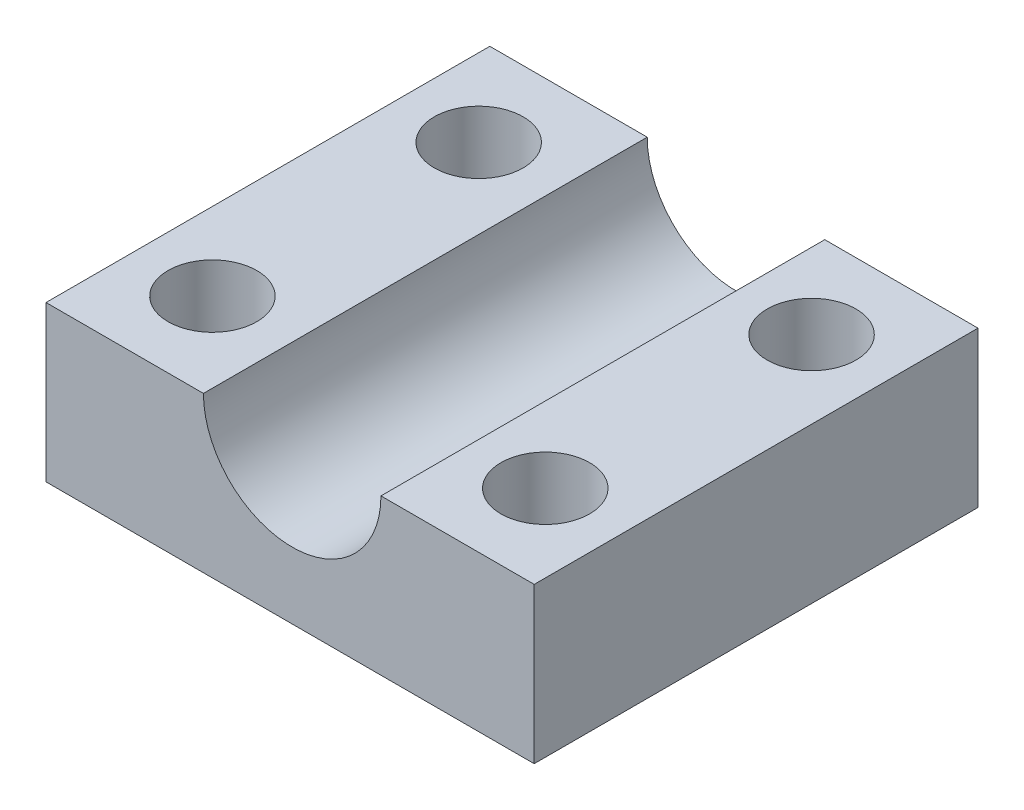
ISO-10303-21;
HEADER;
FILE_DESCRIPTION(('STEP AP214'),'2;1');
FILE_NAME('part.step','',(''),(''),'','','');
FILE_SCHEMA(('AUTOMOTIVE_DESIGN { 1 0 10303 214 1 1 1 1 }'));
ENDSEC;
DATA;
#1=APPLICATION_CONTEXT('core data for automotive mechanical design processes');
#2=APPLICATION_PROTOCOL_DEFINITION('international standard','automotive_design',2000,#1);
#3=PRODUCT_CONTEXT('',#1,'mechanical');
#4=PRODUCT('Part','Part','',(#3));
#5=PRODUCT_RELATED_PRODUCT_CATEGORY('part','',(#4));
#6=PRODUCT_DEFINITION_FORMATION('','',#4);
#7=PRODUCT_DEFINITION_CONTEXT('part definition',#1,'design');
#8=PRODUCT_DEFINITION('design','',#6,#7);
#9=PRODUCT_DEFINITION_SHAPE('','',#8);
#10=(LENGTH_UNIT() NAMED_UNIT(*) SI_UNIT(.MILLI.,.METRE.));
#11=(NAMED_UNIT(*) PLANE_ANGLE_UNIT() SI_UNIT($,.RADIAN.));
#12=(NAMED_UNIT(*) SI_UNIT($,.STERADIAN.) SOLID_ANGLE_UNIT());
#13=UNCERTAINTY_MEASURE_WITH_UNIT(LENGTH_MEASURE(1.E-05),#10,'distance_accuracy_value','');
#14=(GEOMETRIC_REPRESENTATION_CONTEXT(3) GLOBAL_UNCERTAINTY_ASSIGNED_CONTEXT((#13)) GLOBAL_UNIT_ASSIGNED_CONTEXT((#10,
#11,#12)) REPRESENTATION_CONTEXT('',''));
#15=CARTESIAN_POINT('',(0.,0.,0.));
#16=DIRECTION('',(0.,0.,1.));
#17=DIRECTION('',(1.,0.,0.));
#18=AXIS2_PLACEMENT_3D('',#15,#16,#17);
#19=CARTESIAN_POINT('',(0.,14.,0.));
#20=DIRECTION('',(0.,1.,0.));
#21=DIRECTION('',(0.,0.,1.));
#22=AXIS2_PLACEMENT_3D('',#19,#20,#21);
#23=PLANE('',#22);
#24=CARTESIAN_POINT('',(14.8110638894814,14.,8.44236692807907));
#25=DIRECTION('',(0.,1.,0.));
#26=DIRECTION('',(0.,0.,1.));
#27=AXIS2_PLACEMENT_3D('',#24,#25,#26);
#28=CIRCLE('',#27,4.);
#29=CARTESIAN_POINT('',(14.8110638894814,14.,12.4423669280791));
#30=VERTEX_POINT('',#29);
#31=EDGE_CURVE('E124',#30,#30,#28,.T.);
#32=ORIENTED_EDGE('',*,*,#31,.F.);
#33=EDGE_LOOP('',(#32));
#34=FACE_BOUND('',#33,.T.);
#35=CARTESIAN_POINT('',(14.8110638894814,14.,-15.5576330719209));
#36=DIRECTION('',(0.,1.,0.));
#37=DIRECTION('',(0.,0.,1.));
#38=AXIS2_PLACEMENT_3D('',#35,#36,#37);
#39=CIRCLE('',#38,4.);
#40=CARTESIAN_POINT('',(14.8110638894814,14.,-11.5576330719209));
#41=VERTEX_POINT('',#40);
#42=EDGE_CURVE('E158',#41,#41,#39,.T.);
#43=ORIENTED_EDGE('',*,*,#42,.F.);
#44=EDGE_LOOP('',(#43));
#45=FACE_BOUND('',#44,.T.);
#46=DIRECTION('',(-1.,0.,0.));
#47=VECTOR('',#46,1.);
#48=CARTESIAN_POINT('',(-22.1889361105186,14.,-23.5576330719209));
#49=LINE('',#48,#47);
#50=CARTESIAN_POINT('',(21.8110638894814,14.,-23.5576330719209));
#51=VERTEX_POINT('',#50);
#52=CARTESIAN_POINT('',(8.,14.,-23.5576330719209));
#53=VERTEX_POINT('',#52);
#54=EDGE_CURVE('E96',#51,#53,#49,.T.);
#55=ORIENTED_EDGE('',*,*,#54,.T.);
#56=DIRECTION('',(0.,0.,-1.));
#57=VECTOR('',#56,1.);
#58=CARTESIAN_POINT('',(8.,14.,39.0697839260486));
#59=LINE('',#58,#57);
#60=CARTESIAN_POINT('',(8.,14.,16.4423669280791));
#61=VERTEX_POINT('',#60);
#62=EDGE_CURVE('E105',#53,#61,#59,.F.);
#63=ORIENTED_EDGE('',*,*,#62,.T.);
#64=DIRECTION('',(1.,0.,0.));
#65=VECTOR('',#64,1.);
#66=CARTESIAN_POINT('',(-22.1889361105186,14.,16.4423669280791));
#67=LINE('',#66,#65);
#68=CARTESIAN_POINT('',(21.8110638894814,14.,16.4423669280791));
#69=VERTEX_POINT('',#68);
#70=EDGE_CURVE('E66',#61,#69,#67,.T.);
#71=ORIENTED_EDGE('',*,*,#70,.T.);
#72=DIRECTION('',(0.,0.,-1.));
#73=VECTOR('',#72,1.);
#74=CARTESIAN_POINT('',(21.8110638894814,14.,-23.5576330719209));
#75=LINE('',#74,#73);
#76=EDGE_CURVE('E130',#69,#51,#75,.T.);
#77=ORIENTED_EDGE('',*,*,#76,.T.);
#78=EDGE_LOOP('',(#55,#63,#71,#77));
#79=FACE_BOUND('',#78,.T.);
#80=ADVANCED_FACE('F43',(#34,#45,#79),#23,.T.);
#81=CARTESIAN_POINT('',(-15.1889361105186,14.,8.44236692807907));
#82=DIRECTION('',(0.,1.,0.));
#83=DIRECTION('',(0.,0.,1.));
#84=AXIS2_PLACEMENT_3D('',#81,#82,#83);
#85=CIRCLE('',#84,4.);
#86=CARTESIAN_POINT('',(-15.1889361105186,14.,12.4423669280791));
#87=VERTEX_POINT('',#86);
#88=EDGE_CURVE('E172',#87,#87,#85,.T.);
#89=ORIENTED_EDGE('',*,*,#88,.F.);
#90=EDGE_LOOP('',(#89));
#91=FACE_BOUND('',#90,.T.);
#92=CARTESIAN_POINT('',(-15.1889361105186,14.,-15.5576330719209));
#93=DIRECTION('',(0.,1.,0.));
#94=DIRECTION('',(0.,0.,1.));
#95=AXIS2_PLACEMENT_3D('',#92,#93,#94);
#96=CIRCLE('',#95,4.);
#97=CARTESIAN_POINT('',(-15.1889361105186,14.,-11.5576330719209));
#98=VERTEX_POINT('',#97);
#99=EDGE_CURVE('E184',#98,#98,#96,.T.);
#100=ORIENTED_EDGE('',*,*,#99,.F.);
#101=EDGE_LOOP('',(#100));
#102=FACE_BOUND('',#101,.T.);
#103=CARTESIAN_POINT('',(-22.1889361105186,14.,16.4423669280791));
#104=VERTEX_POINT('',#103);
#105=CARTESIAN_POINT('',(-8.,14.,16.4423669280791));
#106=VERTEX_POINT('',#105);
#107=EDGE_CURVE('E113',#104,#106,#67,.T.);
#108=ORIENTED_EDGE('',*,*,#107,.T.);
#109=DIRECTION('',(0.,0.,-1.));
#110=VECTOR('',#109,1.);
#111=CARTESIAN_POINT('',(-8.,14.,39.0697839260486));
#112=LINE('',#111,#110);
#113=CARTESIAN_POINT('',(-8.,14.,-23.5576330719209));
#114=VERTEX_POINT('',#113);
#115=EDGE_CURVE('E57',#106,#114,#112,.T.);
#116=ORIENTED_EDGE('',*,*,#115,.T.);
#117=CARTESIAN_POINT('',(-22.1889361105186,14.,-23.5576330719209));
#118=VERTEX_POINT('',#117);
#119=EDGE_CURVE('E152',#114,#118,#49,.T.);
#120=ORIENTED_EDGE('',*,*,#119,.T.);
#121=DIRECTION('',(0.,0.,1.));
#122=VECTOR('',#121,1.);
#123=CARTESIAN_POINT('',(-22.1889361105186,14.,-23.5576330719209));
#124=LINE('',#123,#122);
#125=EDGE_CURVE('E114',#118,#104,#124,.T.);
#126=ORIENTED_EDGE('',*,*,#125,.T.);
#127=EDGE_LOOP('',(#108,#116,#120,#126));
#128=FACE_BOUND('',#127,.T.);
#129=ADVANCED_FACE('F150',(#91,#102,#128),#23,.T.);
#130=CARTESIAN_POINT('',(0.,0.,0.));
#131=DIRECTION('',(0.,1.,0.));
#132=DIRECTION('',(0.,0.,1.));
#133=AXIS2_PLACEMENT_3D('',#130,#131,#132);
#134=PLANE('',#133);
#135=DIRECTION('',(0.,0.,-1.));
#136=VECTOR('',#135,1.);
#137=CARTESIAN_POINT('',(21.8110638894814,0.,-23.5576330719209));
#138=LINE('',#137,#136);
#139=CARTESIAN_POINT('',(21.8110638894814,0.,16.4423669280791));
#140=VERTEX_POINT('',#139);
#141=CARTESIAN_POINT('',(21.8110638894814,0.,-23.5576330719209));
#142=VERTEX_POINT('',#141);
#143=EDGE_CURVE('E120',#140,#142,#138,.T.);
#144=ORIENTED_EDGE('',*,*,#143,.F.);
#145=DIRECTION('',(1.,0.,0.));
#146=VECTOR('',#145,1.);
#147=CARTESIAN_POINT('',(-22.1889361105186,0.,16.4423669280791));
#148=LINE('',#147,#146);
#149=CARTESIAN_POINT('',(-22.1889361105186,0.,16.4423669280791));
#150=VERTEX_POINT('',#149);
#151=EDGE_CURVE('E88',#150,#140,#148,.T.);
#152=ORIENTED_EDGE('',*,*,#151,.F.);
#153=DIRECTION('',(0.,0.,1.));
#154=VECTOR('',#153,1.);
#155=CARTESIAN_POINT('',(-22.1889361105186,0.,-23.5576330719209));
#156=LINE('',#155,#154);
#157=CARTESIAN_POINT('',(-22.1889361105186,0.,-23.5576330719209));
#158=VERTEX_POINT('',#157);
#159=EDGE_CURVE('E126',#158,#150,#156,.T.);
#160=ORIENTED_EDGE('',*,*,#159,.F.);
#161=DIRECTION('',(-1.,0.,0.));
#162=VECTOR('',#161,1.);
#163=CARTESIAN_POINT('',(-22.1889361105186,0.,-23.5576330719209));
#164=LINE('',#163,#162);
#165=EDGE_CURVE('E123',#142,#158,#164,.T.);
#166=ORIENTED_EDGE('',*,*,#165,.F.);
#167=EDGE_LOOP('',(#144,#152,#160,#166));
#168=FACE_BOUND('',#167,.T.);
#169=CARTESIAN_POINT('',(14.8110638894814,0.,8.44236692807907));
#170=DIRECTION('',(0.,1.,0.));
#171=DIRECTION('',(0.,0.,1.));
#172=AXIS2_PLACEMENT_3D('',#169,#170,#171);
#173=CIRCLE('',#172,4.);
#174=CARTESIAN_POINT('',(14.8110638894814,0.,12.4423669280791));
#175=VERTEX_POINT('',#174);
#176=EDGE_CURVE('E155',#175,#175,#173,.T.);
#177=ORIENTED_EDGE('',*,*,#176,.T.);
#178=EDGE_LOOP('',(#177));
#179=FACE_BOUND('',#178,.T.);
#180=CARTESIAN_POINT('',(14.8110638894814,0.,-15.5576330719209));
#181=DIRECTION('',(0.,1.,0.));
#182=DIRECTION('',(0.,0.,1.));
#183=AXIS2_PLACEMENT_3D('',#180,#181,#182);
#184=CIRCLE('',#183,4.);
#185=CARTESIAN_POINT('',(14.8110638894814,0.,-11.5576330719209));
#186=VERTEX_POINT('',#185);
#187=EDGE_CURVE('E163',#186,#186,#184,.T.);
#188=ORIENTED_EDGE('',*,*,#187,.T.);
#189=EDGE_LOOP('',(#188));
#190=FACE_BOUND('',#189,.T.);
#191=CARTESIAN_POINT('',(-15.1889361105186,0.,-15.5576330719209));
#192=DIRECTION('',(0.,1.,0.));
#193=DIRECTION('',(0.,0.,1.));
#194=AXIS2_PLACEMENT_3D('',#191,#192,#193);
#195=CIRCLE('',#194,4.);
#196=CARTESIAN_POINT('',(-15.1889361105186,0.,-11.5576330719209));
#197=VERTEX_POINT('',#196);
#198=EDGE_CURVE('E177',#197,#197,#195,.T.);
#199=ORIENTED_EDGE('',*,*,#198,.T.);
#200=EDGE_LOOP('',(#199));
#201=FACE_BOUND('',#200,.T.);
#202=CARTESIAN_POINT('',(-15.1889361105186,0.,8.44236692807907));
#203=DIRECTION('',(0.,1.,0.));
#204=DIRECTION('',(0.,0.,1.));
#205=AXIS2_PLACEMENT_3D('',#202,#203,#204);
#206=CIRCLE('',#205,4.);
#207=CARTESIAN_POINT('',(-15.1889361105186,0.,12.4423669280791));
#208=VERTEX_POINT('',#207);
#209=EDGE_CURVE('E108',#208,#208,#206,.T.);
#210=ORIENTED_EDGE('',*,*,#209,.T.);
#211=EDGE_LOOP('',(#210));
#212=FACE_BOUND('',#211,.T.);
#213=ADVANCED_FACE('F142',(#168,#179,#190,#201,#212),#134,.F.);
#214=CARTESIAN_POINT('',(21.8110638894814,14.,-23.5576330719209));
#215=DIRECTION('',(-1.,0.,0.));
#216=DIRECTION('',(0.,0.,1.));
#217=AXIS2_PLACEMENT_3D('',#214,#215,#216);
#218=PLANE('',#217);
#219=ORIENTED_EDGE('',*,*,#143,.T.);
#220=DIRECTION('',(0.,-1.,0.));
#221=VECTOR('',#220,1.);
#222=CARTESIAN_POINT('',(21.8110638894814,14.,-23.5576330719209));
#223=LINE('',#222,#221);
#224=EDGE_CURVE('E51',#51,#142,#223,.T.);
#225=ORIENTED_EDGE('',*,*,#224,.F.);
#226=ORIENTED_EDGE('',*,*,#76,.F.);
#227=DIRECTION('',(0.,-1.,0.));
#228=VECTOR('',#227,1.);
#229=CARTESIAN_POINT('',(21.8110638894814,14.,16.4423669280791));
#230=LINE('',#229,#228);
#231=EDGE_CURVE('E111',#69,#140,#230,.T.);
#232=ORIENTED_EDGE('',*,*,#231,.T.);
#233=EDGE_LOOP('',(#219,#225,#226,#232));
#234=FACE_BOUND('',#233,.T.);
#235=ADVANCED_FACE('F45',(#234),#218,.F.);
#236=CARTESIAN_POINT('',(-22.1889361105186,14.,-23.5576330719209));
#237=DIRECTION('',(0.,0.,1.));
#238=DIRECTION('',(1.,0.,0.));
#239=AXIS2_PLACEMENT_3D('',#236,#237,#238);
#240=PLANE('',#239);
#241=CARTESIAN_POINT('',(0.,14.,-23.5576330719209));
#242=DIRECTION('',(0.,0.,1.));
#243=DIRECTION('',(1.,0.,0.));
#244=AXIS2_PLACEMENT_3D('',#241,#242,#243);
#245=CIRCLE('',#244,8.);
#246=EDGE_CURVE('E373',#53,#114,#245,.F.);
#247=ORIENTED_EDGE('',*,*,#246,.F.);
#248=ORIENTED_EDGE('',*,*,#54,.F.);
#249=ORIENTED_EDGE('',*,*,#224,.T.);
#250=ORIENTED_EDGE('',*,*,#165,.T.);
#251=DIRECTION('',(0.,-1.,0.));
#252=VECTOR('',#251,1.);
#253=CARTESIAN_POINT('',(-22.1889361105186,14.,-23.5576330719209));
#254=LINE('',#253,#252);
#255=EDGE_CURVE('E134',#118,#158,#254,.T.);
#256=ORIENTED_EDGE('',*,*,#255,.F.);
#257=ORIENTED_EDGE('',*,*,#119,.F.);
#258=EDGE_LOOP('',(#247,#248,#249,#250,#256,#257));
#259=FACE_BOUND('',#258,.T.);
#260=ADVANCED_FACE('F137',(#259),#240,.F.);
#261=CARTESIAN_POINT('',(-22.1889361105186,14.,-23.5576330719209));
#262=DIRECTION('',(1.,0.,0.));
#263=DIRECTION('',(0.,0.,-1.));
#264=AXIS2_PLACEMENT_3D('',#261,#262,#263);
#265=PLANE('',#264);
#266=ORIENTED_EDGE('',*,*,#159,.T.);
#267=DIRECTION('',(0.,-1.,0.));
#268=VECTOR('',#267,1.);
#269=CARTESIAN_POINT('',(-22.1889361105186,14.,16.4423669280791));
#270=LINE('',#269,#268);
#271=EDGE_CURVE('E132',#104,#150,#270,.T.);
#272=ORIENTED_EDGE('',*,*,#271,.F.);
#273=ORIENTED_EDGE('',*,*,#125,.F.);
#274=ORIENTED_EDGE('',*,*,#255,.T.);
#275=EDGE_LOOP('',(#266,#272,#273,#274));
#276=FACE_BOUND('',#275,.T.);
#277=ADVANCED_FACE('F147',(#276),#265,.F.);
#278=CARTESIAN_POINT('',(-22.1889361105186,14.,16.4423669280791));
#279=DIRECTION('',(0.,0.,-1.));
#280=DIRECTION('',(-1.,0.,0.));
#281=AXIS2_PLACEMENT_3D('',#278,#279,#280);
#282=PLANE('',#281);
#283=CARTESIAN_POINT('',(0.,14.,16.4423669280791));
#284=DIRECTION('',(0.,0.,-1.));
#285=DIRECTION('',(-1.,0.,0.));
#286=AXIS2_PLACEMENT_3D('',#283,#284,#285);
#287=CIRCLE('',#286,8.);
#288=EDGE_CURVE('E12',#106,#61,#287,.F.);
#289=ORIENTED_EDGE('',*,*,#288,.F.);
#290=ORIENTED_EDGE('',*,*,#107,.F.);
#291=ORIENTED_EDGE('',*,*,#271,.T.);
#292=ORIENTED_EDGE('',*,*,#151,.T.);
#293=ORIENTED_EDGE('',*,*,#231,.F.);
#294=ORIENTED_EDGE('',*,*,#70,.F.);
#295=EDGE_LOOP('',(#289,#290,#291,#292,#293,#294));
#296=FACE_BOUND('',#295,.T.);
#297=ADVANCED_FACE('F110',(#296),#282,.F.);
#298=CARTESIAN_POINT('',(14.8110638894814,14.,8.44236692807907));
#299=DIRECTION('',(0.,-1.,0.));
#300=DIRECTION('',(0.,0.,-1.));
#301=AXIS2_PLACEMENT_3D('',#298,#299,#300);
#302=CYLINDRICAL_SURFACE('',#301,4.);
#303=ORIENTED_EDGE('',*,*,#31,.T.);
#304=EDGE_LOOP('',(#303));
#305=FACE_BOUND('',#304,.T.);
#306=ORIENTED_EDGE('',*,*,#176,.F.);
#307=EDGE_LOOP('',(#306));
#308=FACE_BOUND('',#307,.T.);
#309=ADVANCED_FACE('F210',(#305,#308),#302,.F.);
#310=CARTESIAN_POINT('',(14.8110638894814,14.,-15.5576330719209));
#311=DIRECTION('',(0.,-1.,0.));
#312=DIRECTION('',(0.,0.,-1.));
#313=AXIS2_PLACEMENT_3D('',#310,#311,#312);
#314=CYLINDRICAL_SURFACE('',#313,4.);
#315=ORIENTED_EDGE('',*,*,#42,.T.);
#316=EDGE_LOOP('',(#315));
#317=FACE_BOUND('',#316,.T.);
#318=ORIENTED_EDGE('',*,*,#187,.F.);
#319=EDGE_LOOP('',(#318));
#320=FACE_BOUND('',#319,.T.);
#321=ADVANCED_FACE('F207',(#317,#320),#314,.F.);
#322=CARTESIAN_POINT('',(-15.1889361105186,14.,-15.5576330719209));
#323=DIRECTION('',(0.,-1.,0.));
#324=DIRECTION('',(0.,0.,-1.));
#325=AXIS2_PLACEMENT_3D('',#322,#323,#324);
#326=CYLINDRICAL_SURFACE('',#325,4.);
#327=ORIENTED_EDGE('',*,*,#99,.T.);
#328=EDGE_LOOP('',(#327));
#329=FACE_BOUND('',#328,.T.);
#330=ORIENTED_EDGE('',*,*,#198,.F.);
#331=EDGE_LOOP('',(#330));
#332=FACE_BOUND('',#331,.T.);
#333=ADVANCED_FACE('F209',(#329,#332),#326,.F.);
#334=CARTESIAN_POINT('',(-15.1889361105186,14.,8.44236692807907));
#335=DIRECTION('',(0.,-1.,0.));
#336=DIRECTION('',(0.,0.,-1.));
#337=AXIS2_PLACEMENT_3D('',#334,#335,#336);
#338=CYLINDRICAL_SURFACE('',#337,4.);
#339=ORIENTED_EDGE('',*,*,#88,.T.);
#340=EDGE_LOOP('',(#339));
#341=FACE_BOUND('',#340,.T.);
#342=ORIENTED_EDGE('',*,*,#209,.F.);
#343=EDGE_LOOP('',(#342));
#344=FACE_BOUND('',#343,.T.);
#345=ADVANCED_FACE('F216',(#341,#344),#338,.F.);
#346=CARTESIAN_POINT('',(0.,14.,39.0697839260486));
#347=DIRECTION('',(0.,0.,-1.));
#348=DIRECTION('',(-1.,0.,0.));
#349=AXIS2_PLACEMENT_3D('',#346,#347,#348);
#350=CYLINDRICAL_SURFACE('',#349,8.);
#351=ORIENTED_EDGE('',*,*,#246,.T.);
#352=ORIENTED_EDGE('',*,*,#115,.F.);
#353=ORIENTED_EDGE('',*,*,#288,.T.);
#354=ORIENTED_EDGE('',*,*,#62,.F.);
#355=EDGE_LOOP('',(#351,#352,#353,#354));
#356=FACE_BOUND('',#355,.T.);
#357=ADVANCED_FACE('F104',(#356),#350,.F.);
#358=CLOSED_SHELL('',(#80,#129,#213,#235,#260,#277,#297,#309,#321,#333,#345,#357));
#359=MANIFOLD_SOLID_BREP('B2',#358);
#360=ADVANCED_BREP_SHAPE_REPRESENTATION('',(#18,#359),#14);
#361=SHAPE_DEFINITION_REPRESENTATION(#9,#360);
ENDSEC;
END-ISO-10303-21;
